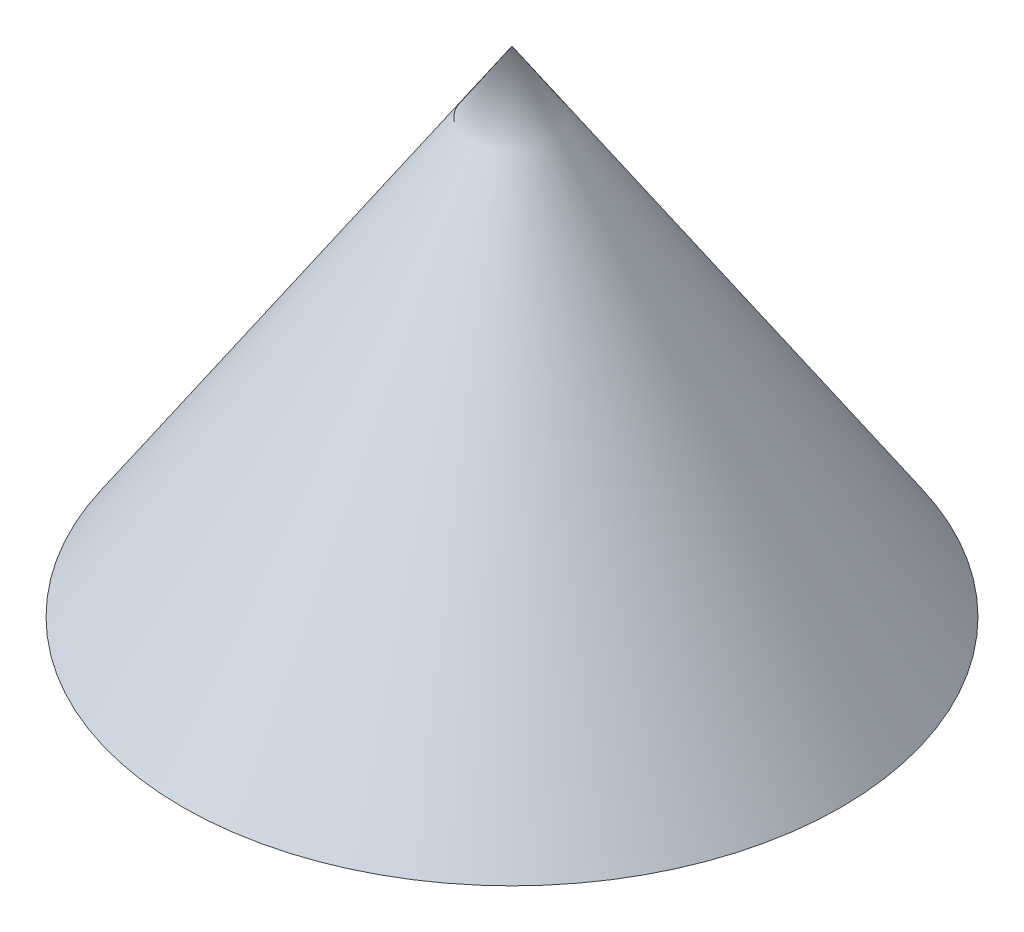
ISO-10303-21;
HEADER;
FILE_DESCRIPTION(('STEP AP214'),'2;1');
FILE_NAME('part.step','',(''),(''),'','','');
FILE_SCHEMA(('AUTOMOTIVE_DESIGN { 1 0 10303 214 1 1 1 1 }'));
ENDSEC;
DATA;
#1=APPLICATION_CONTEXT('core data for automotive mechanical design processes');
#2=APPLICATION_PROTOCOL_DEFINITION('international standard','automotive_design',2000,#1);
#3=PRODUCT_CONTEXT('',#1,'mechanical');
#4=PRODUCT('Part','Part','',(#3));
#5=PRODUCT_RELATED_PRODUCT_CATEGORY('part','',(#4));
#6=PRODUCT_DEFINITION_FORMATION('','',#4);
#7=PRODUCT_DEFINITION_CONTEXT('part definition',#1,'design');
#8=PRODUCT_DEFINITION('design','',#6,#7);
#9=PRODUCT_DEFINITION_SHAPE('','',#8);
#10=(LENGTH_UNIT() NAMED_UNIT(*) SI_UNIT(.MILLI.,.METRE.));
#11=(NAMED_UNIT(*) PLANE_ANGLE_UNIT() SI_UNIT($,.RADIAN.));
#12=(NAMED_UNIT(*) SI_UNIT($,.STERADIAN.) SOLID_ANGLE_UNIT());
#13=UNCERTAINTY_MEASURE_WITH_UNIT(LENGTH_MEASURE(1.E-05),#10,'distance_accuracy_value','');
#14=(GEOMETRIC_REPRESENTATION_CONTEXT(3) GLOBAL_UNCERTAINTY_ASSIGNED_CONTEXT((#13)) GLOBAL_UNIT_ASSIGNED_CONTEXT((#10,
#11,#12)) REPRESENTATION_CONTEXT('',''));
#15=CARTESIAN_POINT('',(0.,0.,0.));
#16=DIRECTION('',(0.,0.,1.));
#17=DIRECTION('',(1.,0.,0.));
#18=AXIS2_PLACEMENT_3D('',#15,#16,#17);
#19=CARTESIAN_POINT('',(70.,0.,0.));
#20=DIRECTION('',(0.,-1.,0.));
#21=DIRECTION('',(0.,0.,-1.));
#22=AXIS2_PLACEMENT_3D('',#19,#20,#21);
#23=PLANE('',#22);
#24=CARTESIAN_POINT('',(0.,0.,0.));
#25=DIRECTION('',(0.,-1.,0.));
#26=DIRECTION('',(0.,0.,-1.));
#27=AXIS2_PLACEMENT_3D('',#24,#25,#26);
#28=CIRCLE('',#27,70.);
#29=CARTESIAN_POINT('',(0.,0.,-70.));
#30=VERTEX_POINT('',#29);
#31=EDGE_CURVE('E11',#30,#30,#28,.T.);
#32=ORIENTED_EDGE('',*,*,#31,.T.);
#33=EDGE_LOOP('',(#32));
#34=FACE_BOUND('',#33,.T.);
#35=ADVANCED_FACE('F33',(#34),#23,.T.);
#36=CARTESIAN_POINT('',(0.,0.,0.));
#37=DIRECTION('',(0.,-1.,0.));
#38=DIRECTION('',(0.,0.,-1.));
#39=AXIS2_PLACEMENT_3D('',#36,#37,#38);
#40=CONICAL_SURFACE('',#39,70.,0.588002603547568);
#41=CARTESIAN_POINT('',(0.,105.,0.));
#42=VERTEX_POINT('',#41);
#43=VERTEX_LOOP('',#42);
#44=FACE_BOUND('',#43,.T.);
#45=ORIENTED_EDGE('',*,*,#31,.F.);
#46=EDGE_LOOP('',(#45));
#47=FACE_BOUND('',#46,.T.);
#48=ADVANCED_FACE('F40',(#44,#47),#40,.T.);
#49=CLOSED_SHELL('',(#35,#48));
#50=MANIFOLD_SOLID_BREP('B2',#49);
#51=ADVANCED_BREP_SHAPE_REPRESENTATION('',(#18,#50),#14);
#52=SHAPE_DEFINITION_REPRESENTATION(#9,#51);
ENDSEC;
END-ISO-10303-21;
